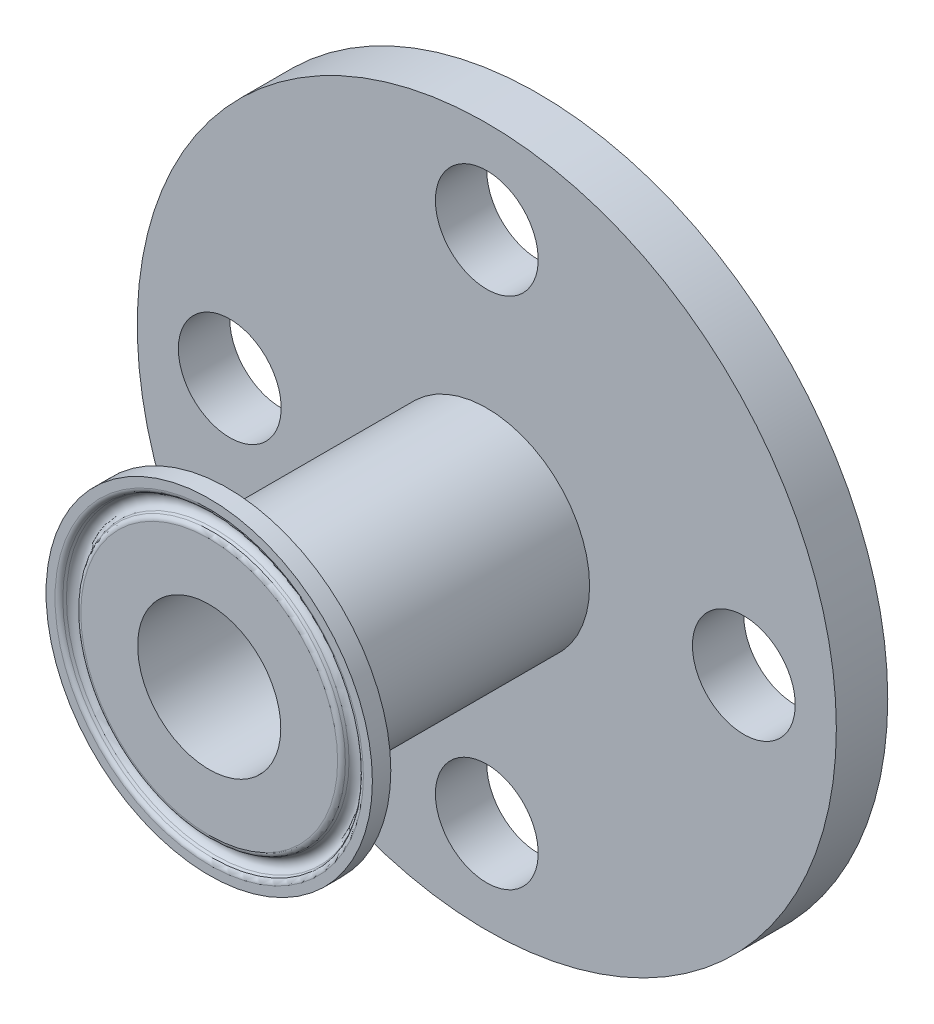
ISO-10303-21;
HEADER;
FILE_DESCRIPTION(('STEP AP214'),'2;1');
FILE_NAME('part.step','',(''),(''),'','','');
FILE_SCHEMA(('AUTOMOTIVE_DESIGN { 1 0 10303 214 1 1 1 1 }'));
ENDSEC;
DATA;
#1=APPLICATION_CONTEXT('core data for automotive mechanical design processes');
#2=APPLICATION_PROTOCOL_DEFINITION('international standard','automotive_design',2000,#1);
#3=PRODUCT_CONTEXT('',#1,'mechanical');
#4=PRODUCT('Part','Part','',(#3));
#5=PRODUCT_RELATED_PRODUCT_CATEGORY('part','',(#4));
#6=PRODUCT_DEFINITION_FORMATION('','',#4);
#7=PRODUCT_DEFINITION_CONTEXT('part definition',#1,'design');
#8=PRODUCT_DEFINITION('design','',#6,#7);
#9=PRODUCT_DEFINITION_SHAPE('','',#8);
#10=(LENGTH_UNIT() NAMED_UNIT(*) SI_UNIT(.MILLI.,.METRE.));
#11=(NAMED_UNIT(*) PLANE_ANGLE_UNIT() SI_UNIT($,.RADIAN.));
#12=(NAMED_UNIT(*) SI_UNIT($,.STERADIAN.) SOLID_ANGLE_UNIT());
#13=UNCERTAINTY_MEASURE_WITH_UNIT(LENGTH_MEASURE(1.E-05),#10,'distance_accuracy_value','');
#14=(GEOMETRIC_REPRESENTATION_CONTEXT(3) GLOBAL_UNCERTAINTY_ASSIGNED_CONTEXT((#13)) GLOBAL_UNIT_ASSIGNED_CONTEXT((#10,
#11,#12)) REPRESENTATION_CONTEXT('',''));
#15=CARTESIAN_POINT('',(0.,0.,0.));
#16=DIRECTION('',(0.,0.,1.));
#17=DIRECTION('',(1.,0.,0.));
#18=AXIS2_PLACEMENT_3D('',#15,#16,#17);
#19=CARTESIAN_POINT('',(0.,23.8091722747395,0.));
#20=DIRECTION('',(0.,0.,-1.));
#21=DIRECTION('',(-1.,0.,0.));
#22=AXIS2_PLACEMENT_3D('',#19,#20,#21);
#23=PLANE('',#22);
#24=CARTESIAN_POINT('',(0.,0.,0.));
#25=DIRECTION('',(0.,0.,1.));
#26=DIRECTION('',(1.,0.,0.));
#27=AXIS2_PLACEMENT_3D('',#24,#25,#26);
#28=CIRCLE('',#27,23.8091722747395);
#29=CARTESIAN_POINT('',(23.8091722747395,0.,0.));
#30=VERTEX_POINT('',#29);
#31=EDGE_CURVE('E10',#30,#30,#28,.T.);
#32=ORIENTED_EDGE('',*,*,#31,.F.);
#33=EDGE_LOOP('',(#32));
#34=FACE_BOUND('',#33,.T.);
#35=CARTESIAN_POINT('',(0.,0.,0.));
#36=DIRECTION('',(0.,0.,1.));
#37=DIRECTION('',(1.,0.,0.));
#38=AXIS2_PLACEMENT_3D('',#35,#36,#37);
#39=CIRCLE('',#38,25.1968);
#40=CARTESIAN_POINT('',(25.1968,0.,0.));
#41=VERTEX_POINT('',#40);
#42=EDGE_CURVE('E84',#41,#41,#39,.T.);
#43=ORIENTED_EDGE('',*,*,#42,.T.);
#44=EDGE_LOOP('',(#43));
#45=FACE_BOUND('',#44,.T.);
#46=ADVANCED_FACE('F35',(#34,#45),#23,.F.);
#47=CARTESIAN_POINT('',(0.,0.,-0.7874));
#48=DIRECTION('',(0.,0.,1.));
#49=DIRECTION('',(1.,0.,0.));
#50=AXIS2_PLACEMENT_3D('',#47,#48,#49);
#51=TOROIDAL_SURFACE('',#50,23.8091722747395,0.787400000000001);
#52=CARTESIAN_POINT('',(0.,0.,-0.479738309427546));
#53=DIRECTION('',(0.,0.,1.));
#54=DIRECTION('',(1.,0.,0.));
#55=AXIS2_PLACEMENT_3D('',#52,#53,#54);
#56=CIRCLE('',#55,23.0843667531311);
#57=CARTESIAN_POINT('',(23.0843667531311,0.,-0.479738309427546));
#58=VERTEX_POINT('',#57);
#59=EDGE_CURVE('E41',#58,#58,#56,.T.);
#60=ORIENTED_EDGE('',*,*,#59,.F.);
#61=EDGE_LOOP('',(#60));
#62=FACE_BOUND('',#61,.T.);
#63=ORIENTED_EDGE('',*,*,#31,.T.);
#64=EDGE_LOOP('',(#63));
#65=FACE_BOUND('',#64,.T.);
#66=ADVANCED_FACE('F161',(#62,#65),#51,.T.);
#67=CARTESIAN_POINT('',(0.,0.,-0.479738309427546));
#68=DIRECTION('',(0.,0.,1.));
#69=DIRECTION('',(1.,0.,0.));
#70=AXIS2_PLACEMENT_3D('',#67,#68,#69);
#71=CONICAL_SURFACE('',#70,23.0843667531311,0.401425727958695);
#72=CARTESIAN_POINT('',(0.,0.,-0.872854821190492));
#73=DIRECTION('',(0.,0.,1.));
#74=DIRECTION('',(1.,0.,0.));
#75=AXIS2_PLACEMENT_3D('',#72,#73,#74);
#76=CIRCLE('',#75,22.9174986940515);
#77=CARTESIAN_POINT('',(22.9174986940515,0.,-0.872854821190492));
#78=VERTEX_POINT('',#77);
#79=EDGE_CURVE('E45',#78,#78,#76,.T.);
#80=ORIENTED_EDGE('',*,*,#79,.F.);
#81=EDGE_LOOP('',(#80));
#82=FACE_BOUND('',#81,.T.);
#83=ORIENTED_EDGE('',*,*,#59,.T.);
#84=EDGE_LOOP('',(#83));
#85=FACE_BOUND('',#84,.T.);
#86=ADVANCED_FACE('F156',(#82,#85),#71,.F.);
#87=CARTESIAN_POINT('',(0.,0.,-0.4064));
#88=DIRECTION('',(0.,0.,1.));
#89=DIRECTION('',(1.,0.,0.));
#90=AXIS2_PLACEMENT_3D('',#87,#88,#89);
#91=TOROIDAL_SURFACE('',#90,21.8186,1.1938);
#92=CARTESIAN_POINT('',(0.,0.,-0.872854821190497));
#93=DIRECTION('',(0.,0.,1.));
#94=DIRECTION('',(1.,0.,0.));
#95=AXIS2_PLACEMENT_3D('',#92,#93,#94);
#96=CIRCLE('',#95,20.7197013059485);
#97=CARTESIAN_POINT('',(20.7197013059485,0.,-0.872854821190497));
#98=VERTEX_POINT('',#97);
#99=EDGE_CURVE('E49',#98,#98,#96,.T.);
#100=ORIENTED_EDGE('',*,*,#99,.F.);
#101=EDGE_LOOP('',(#100));
#102=FACE_BOUND('',#101,.T.);
#103=ORIENTED_EDGE('',*,*,#79,.T.);
#104=EDGE_LOOP('',(#103));
#105=FACE_BOUND('',#104,.T.);
#106=ADVANCED_FACE('F150',(#102,#105),#91,.F.);
#107=CARTESIAN_POINT('',(0.,0.,-0.872854821190497));
#108=DIRECTION('',(0.,0.,-1.));
#109=DIRECTION('',(-1.,0.,0.));
#110=AXIS2_PLACEMENT_3D('',#107,#108,#109);
#111=CONICAL_SURFACE('',#110,20.7197013059485,0.401425727958704);
#112=CARTESIAN_POINT('',(0.,0.,-0.479738309427545));
#113=DIRECTION('',(0.,0.,1.));
#114=DIRECTION('',(1.,0.,0.));
#115=AXIS2_PLACEMENT_3D('',#112,#113,#114);
#116=CIRCLE('',#115,20.5528332468689);
#117=CARTESIAN_POINT('',(20.5528332468689,0.,-0.479738309427545));
#118=VERTEX_POINT('',#117);
#119=EDGE_CURVE('E54',#118,#118,#116,.T.);
#120=ORIENTED_EDGE('',*,*,#119,.F.);
#121=EDGE_LOOP('',(#120));
#122=FACE_BOUND('',#121,.T.);
#123=ORIENTED_EDGE('',*,*,#99,.T.);
#124=EDGE_LOOP('',(#123));
#125=FACE_BOUND('',#124,.T.);
#126=ADVANCED_FACE('F144',(#122,#125),#111,.T.);
#127=CARTESIAN_POINT('',(0.,0.,-0.7874));
#128=DIRECTION('',(0.,0.,1.));
#129=DIRECTION('',(1.,0.,0.));
#130=AXIS2_PLACEMENT_3D('',#127,#128,#129);
#131=TOROIDAL_SURFACE('',#130,19.8280277252605,0.787400000000003);
#132=CARTESIAN_POINT('',(0.,0.,0.));
#133=DIRECTION('',(0.,0.,1.));
#134=DIRECTION('',(1.,0.,0.));
#135=AXIS2_PLACEMENT_3D('',#132,#133,#134);
#136=CIRCLE('',#135,19.8280277252605);
#137=CARTESIAN_POINT('',(19.8280277252605,0.,0.));
#138=VERTEX_POINT('',#137);
#139=EDGE_CURVE('E57',#138,#138,#136,.T.);
#140=ORIENTED_EDGE('',*,*,#139,.F.);
#141=EDGE_LOOP('',(#140));
#142=FACE_BOUND('',#141,.T.);
#143=ORIENTED_EDGE('',*,*,#119,.T.);
#144=EDGE_LOOP('',(#143));
#145=FACE_BOUND('',#144,.T.);
#146=ADVANCED_FACE('F138',(#142,#145),#131,.T.);
#147=CARTESIAN_POINT('',(0.,11.049,0.));
#148=DIRECTION('',(0.,0.,-1.));
#149=DIRECTION('',(-1.,0.,0.));
#150=AXIS2_PLACEMENT_3D('',#147,#148,#149);
#151=PLANE('',#150);
#152=CARTESIAN_POINT('',(0.,0.,0.));
#153=DIRECTION('',(0.,0.,1.));
#154=DIRECTION('',(1.,0.,0.));
#155=AXIS2_PLACEMENT_3D('',#152,#153,#154);
#156=CIRCLE('',#155,11.049);
#157=CARTESIAN_POINT('',(11.049,0.,0.));
#158=VERTEX_POINT('',#157);
#159=EDGE_CURVE('E60',#158,#158,#156,.T.);
#160=ORIENTED_EDGE('',*,*,#159,.F.);
#161=EDGE_LOOP('',(#160));
#162=FACE_BOUND('',#161,.T.);
#163=ORIENTED_EDGE('',*,*,#139,.T.);
#164=EDGE_LOOP('',(#163));
#165=FACE_BOUND('',#164,.T.);
#166=ADVANCED_FACE('F132',(#162,#165),#151,.F.);
#167=CARTESIAN_POINT('',(0.,0.,0.));
#168=DIRECTION('',(0.,0.,1.));
#169=DIRECTION('',(1.,0.,0.));
#170=AXIS2_PLACEMENT_3D('',#167,#168,#169);
#171=CYLINDRICAL_SURFACE('',#170,11.049);
#172=CARTESIAN_POINT('',(0.,0.,-50.8));
#173=DIRECTION('',(0.,0.,1.));
#174=DIRECTION('',(1.,0.,0.));
#175=AXIS2_PLACEMENT_3D('',#172,#173,#174);
#176=CIRCLE('',#175,11.049);
#177=CARTESIAN_POINT('',(11.049,0.,-50.8));
#178=VERTEX_POINT('',#177);
#179=EDGE_CURVE('E63',#178,#178,#176,.T.);
#180=ORIENTED_EDGE('',*,*,#179,.F.);
#181=EDGE_LOOP('',(#180));
#182=FACE_BOUND('',#181,.T.);
#183=ORIENTED_EDGE('',*,*,#159,.T.);
#184=EDGE_LOOP('',(#183));
#185=FACE_BOUND('',#184,.T.);
#186=ADVANCED_FACE('F118',(#182,#185),#171,.F.);
#187=CARTESIAN_POINT('',(0.,28.575,-50.8));
#188=DIRECTION('',(0.,0.,1.));
#189=DIRECTION('',(1.,0.,0.));
#190=AXIS2_PLACEMENT_3D('',#187,#188,#189);
#191=PLANE('',#190);
#192=CARTESIAN_POINT('',(39.6875,0.,-50.8));
#193=DIRECTION('',(0.,0.,-1.));
#194=DIRECTION('',(-1.,0.,0.));
#195=AXIS2_PLACEMENT_3D('',#192,#193,#194);
#196=CIRCLE('',#195,7.9375);
#197=CARTESIAN_POINT('',(31.75,0.,-50.8));
#198=VERTEX_POINT('',#197);
#199=EDGE_CURVE('E108',#198,#198,#196,.T.);
#200=ORIENTED_EDGE('',*,*,#199,.F.);
#201=EDGE_LOOP('',(#200));
#202=FACE_BOUND('',#201,.T.);
#203=CARTESIAN_POINT('',(0.,-39.6875,-50.8));
#204=DIRECTION('',(0.,0.,-1.));
#205=DIRECTION('',(-1.,0.,0.));
#206=AXIS2_PLACEMENT_3D('',#203,#204,#205);
#207=CIRCLE('',#206,7.9375);
#208=CARTESIAN_POINT('',(-7.9375,-39.6875,-50.8));
#209=VERTEX_POINT('',#208);
#210=EDGE_CURVE('E102',#209,#209,#207,.T.);
#211=ORIENTED_EDGE('',*,*,#210,.F.);
#212=EDGE_LOOP('',(#211));
#213=FACE_BOUND('',#212,.T.);
#214=CARTESIAN_POINT('',(-39.6875,0.,-50.8));
#215=DIRECTION('',(0.,0.,-1.));
#216=DIRECTION('',(-1.,0.,0.));
#217=AXIS2_PLACEMENT_3D('',#214,#215,#216);
#218=CIRCLE('',#217,7.9375);
#219=CARTESIAN_POINT('',(-47.625,0.,-50.8));
#220=VERTEX_POINT('',#219);
#221=EDGE_CURVE('E96',#220,#220,#218,.T.);
#222=ORIENTED_EDGE('',*,*,#221,.F.);
#223=EDGE_LOOP('',(#222));
#224=FACE_BOUND('',#223,.T.);
#225=CARTESIAN_POINT('',(0.,39.6875,-50.8));
#226=DIRECTION('',(0.,0.,-1.));
#227=DIRECTION('',(-1.,0.,0.));
#228=AXIS2_PLACEMENT_3D('',#225,#226,#227);
#229=CIRCLE('',#228,7.9375);
#230=CARTESIAN_POINT('',(-7.9375,39.6875,-50.8));
#231=VERTEX_POINT('',#230);
#232=EDGE_CURVE('E90',#231,#231,#229,.T.);
#233=ORIENTED_EDGE('',*,*,#232,.F.);
#234=EDGE_LOOP('',(#233));
#235=FACE_BOUND('',#234,.T.);
#236=CARTESIAN_POINT('',(0.,0.,-50.8));
#237=DIRECTION('',(0.,0.,1.));
#238=DIRECTION('',(1.,0.,0.));
#239=AXIS2_PLACEMENT_3D('',#236,#237,#238);
#240=CIRCLE('',#239,53.975);
#241=CARTESIAN_POINT('',(53.975,0.,-50.8));
#242=VERTEX_POINT('',#241);
#243=EDGE_CURVE('E66',#242,#242,#240,.T.);
#244=ORIENTED_EDGE('',*,*,#243,.F.);
#245=EDGE_LOOP('',(#244));
#246=FACE_BOUND('',#245,.T.);
#247=ORIENTED_EDGE('',*,*,#179,.T.);
#248=EDGE_LOOP('',(#247));
#249=FACE_BOUND('',#248,.T.);
#250=ADVANCED_FACE('F114',(#202,#213,#224,#235,#246,#249),#191,.F.);
#251=CARTESIAN_POINT('',(0.,0.,0.));
#252=DIRECTION('',(0.,0.,1.));
#253=DIRECTION('',(1.,0.,0.));
#254=AXIS2_PLACEMENT_3D('',#251,#252,#253);
#255=CYLINDRICAL_SURFACE('',#254,53.975);
#256=CARTESIAN_POINT('',(0.,0.,-42.8625));
#257=DIRECTION('',(0.,0.,1.));
#258=DIRECTION('',(1.,0.,0.));
#259=AXIS2_PLACEMENT_3D('',#256,#257,#258);
#260=CIRCLE('',#259,53.975);
#261=CARTESIAN_POINT('',(53.975,0.,-42.8625));
#262=VERTEX_POINT('',#261);
#263=EDGE_CURVE('E69',#262,#262,#260,.T.);
#264=ORIENTED_EDGE('',*,*,#263,.F.);
#265=EDGE_LOOP('',(#264));
#266=FACE_BOUND('',#265,.T.);
#267=ORIENTED_EDGE('',*,*,#243,.T.);
#268=EDGE_LOOP('',(#267));
#269=FACE_BOUND('',#268,.T.);
#270=ADVANCED_FACE('F117',(#266,#269),#255,.T.);
#271=CARTESIAN_POINT('',(0.,15.875,-42.8625));
#272=DIRECTION('',(0.,0.,-1.));
#273=DIRECTION('',(-1.,0.,0.));
#274=AXIS2_PLACEMENT_3D('',#271,#272,#273);
#275=PLANE('',#274);
#276=CARTESIAN_POINT('',(39.6875,0.,-42.8625));
#277=DIRECTION('',(0.,0.,-1.));
#278=DIRECTION('',(-1.,0.,0.));
#279=AXIS2_PLACEMENT_3D('',#276,#277,#278);
#280=CIRCLE('',#279,7.9375);
#281=CARTESIAN_POINT('',(31.75,0.,-42.8625));
#282=VERTEX_POINT('',#281);
#283=EDGE_CURVE('E105',#282,#282,#280,.F.);
#284=ORIENTED_EDGE('',*,*,#283,.F.);
#285=EDGE_LOOP('',(#284));
#286=FACE_BOUND('',#285,.T.);
#287=CARTESIAN_POINT('',(0.,-39.6875,-42.8625));
#288=DIRECTION('',(0.,0.,-1.));
#289=DIRECTION('',(-1.,0.,0.));
#290=AXIS2_PLACEMENT_3D('',#287,#288,#289);
#291=CIRCLE('',#290,7.9375);
#292=CARTESIAN_POINT('',(-7.9375,-39.6875,-42.8625));
#293=VERTEX_POINT('',#292);
#294=EDGE_CURVE('E99',#293,#293,#291,.F.);
#295=ORIENTED_EDGE('',*,*,#294,.F.);
#296=EDGE_LOOP('',(#295));
#297=FACE_BOUND('',#296,.T.);
#298=CARTESIAN_POINT('',(-39.6875,0.,-42.8625));
#299=DIRECTION('',(0.,0.,-1.));
#300=DIRECTION('',(-1.,0.,0.));
#301=AXIS2_PLACEMENT_3D('',#298,#299,#300);
#302=CIRCLE('',#301,7.9375);
#303=CARTESIAN_POINT('',(-47.625,0.,-42.8625));
#304=VERTEX_POINT('',#303);
#305=EDGE_CURVE('E93',#304,#304,#302,.F.);
#306=ORIENTED_EDGE('',*,*,#305,.F.);
#307=EDGE_LOOP('',(#306));
#308=FACE_BOUND('',#307,.T.);
#309=CARTESIAN_POINT('',(0.,39.6875,-42.8625));
#310=DIRECTION('',(0.,0.,-1.));
#311=DIRECTION('',(-1.,0.,0.));
#312=AXIS2_PLACEMENT_3D('',#309,#310,#311);
#313=CIRCLE('',#312,7.9375);
#314=CARTESIAN_POINT('',(-7.9375,39.6875,-42.8625));
#315=VERTEX_POINT('',#314);
#316=EDGE_CURVE('E87',#315,#315,#313,.F.);
#317=ORIENTED_EDGE('',*,*,#316,.F.);
#318=EDGE_LOOP('',(#317));
#319=FACE_BOUND('',#318,.T.);
#320=CARTESIAN_POINT('',(0.,0.,-42.8625));
#321=DIRECTION('',(0.,0.,1.));
#322=DIRECTION('',(1.,0.,0.));
#323=AXIS2_PLACEMENT_3D('',#320,#321,#322);
#324=CIRCLE('',#323,15.875);
#325=CARTESIAN_POINT('',(15.875,0.,-42.8625));
#326=VERTEX_POINT('',#325);
#327=EDGE_CURVE('E72',#326,#326,#324,.T.);
#328=ORIENTED_EDGE('',*,*,#327,.F.);
#329=EDGE_LOOP('',(#328));
#330=FACE_BOUND('',#329,.T.);
#331=ORIENTED_EDGE('',*,*,#263,.T.);
#332=EDGE_LOOP('',(#331));
#333=FACE_BOUND('',#332,.T.);
#334=ADVANCED_FACE('F196',(#286,#297,#308,#319,#330,#333),#275,.F.);
#335=CARTESIAN_POINT('',(0.,0.,0.));
#336=DIRECTION('',(0.,0.,1.));
#337=DIRECTION('',(1.,0.,0.));
#338=AXIS2_PLACEMENT_3D('',#335,#336,#337);
#339=CYLINDRICAL_SURFACE('',#338,15.875);
#340=CARTESIAN_POINT('',(0.,0.,-8.46081666359846));
#341=DIRECTION('',(0.,0.,1.));
#342=DIRECTION('',(1.,0.,0.));
#343=AXIS2_PLACEMENT_3D('',#340,#341,#342);
#344=CIRCLE('',#343,15.875);
#345=CARTESIAN_POINT('',(15.875,0.,-8.46081666359846));
#346=VERTEX_POINT('',#345);
#347=EDGE_CURVE('E75',#346,#346,#344,.T.);
#348=ORIENTED_EDGE('',*,*,#347,.F.);
#349=EDGE_LOOP('',(#348));
#350=FACE_BOUND('',#349,.T.);
#351=ORIENTED_EDGE('',*,*,#327,.T.);
#352=EDGE_LOOP('',(#351));
#353=FACE_BOUND('',#352,.T.);
#354=ADVANCED_FACE('F190',(#350,#353),#339,.T.);
#355=CARTESIAN_POINT('',(0.,0.,-8.46081666359846));
#356=DIRECTION('',(0.,0.,1.));
#357=DIRECTION('',(1.,0.,0.));
#358=AXIS2_PLACEMENT_3D('',#355,#356,#357);
#359=TOROIDAL_SURFACE('',#358,19.05,3.175);
#360=CARTESIAN_POINT('',(0.,0.,-5.4772925926032));
#361=DIRECTION('',(0.,0.,1.));
#362=DIRECTION('',(1.,0.,0.));
#363=AXIS2_PLACEMENT_3D('',#360,#361,#362);
#364=CIRCLE('',#363,17.964086044941);
#365=CARTESIAN_POINT('',(17.964086044941,0.,-5.4772925926032));
#366=VERTEX_POINT('',#365);
#367=EDGE_CURVE('E78',#366,#366,#364,.T.);
#368=ORIENTED_EDGE('',*,*,#367,.F.);
#369=EDGE_LOOP('',(#368));
#370=FACE_BOUND('',#369,.T.);
#371=ORIENTED_EDGE('',*,*,#347,.T.);
#372=EDGE_LOOP('',(#371));
#373=FACE_BOUND('',#372,.T.);
#374=ADVANCED_FACE('F184',(#370,#373),#359,.F.);
#375=CARTESIAN_POINT('',(0.,0.,-5.4772925926032));
#376=DIRECTION('',(0.,0.,1.));
#377=DIRECTION('',(1.,0.,0.));
#378=AXIS2_PLACEMENT_3D('',#375,#376,#377);
#379=CONICAL_SURFACE('',#378,17.964086044941,1.22173047639604);
#380=CARTESIAN_POINT('',(0.,0.,-2.8448));
#381=DIRECTION('',(0.,0.,1.));
#382=DIRECTION('',(1.,0.,0.));
#383=AXIS2_PLACEMENT_3D('',#380,#381,#382);
#384=CIRCLE('',#383,25.1968);
#385=CARTESIAN_POINT('',(25.1968,0.,-2.8448));
#386=VERTEX_POINT('',#385);
#387=EDGE_CURVE('E81',#386,#386,#384,.T.);
#388=ORIENTED_EDGE('',*,*,#387,.F.);
#389=EDGE_LOOP('',(#388));
#390=FACE_BOUND('',#389,.T.);
#391=ORIENTED_EDGE('',*,*,#367,.T.);
#392=EDGE_LOOP('',(#391));
#393=FACE_BOUND('',#392,.T.);
#394=ADVANCED_FACE('F178',(#390,#393),#379,.T.);
#395=CARTESIAN_POINT('',(0.,0.,0.));
#396=DIRECTION('',(0.,0.,1.));
#397=DIRECTION('',(1.,0.,0.));
#398=AXIS2_PLACEMENT_3D('',#395,#396,#397);
#399=CYLINDRICAL_SURFACE('',#398,25.1968);
#400=ORIENTED_EDGE('',*,*,#42,.F.);
#401=EDGE_LOOP('',(#400));
#402=FACE_BOUND('',#401,.T.);
#403=ORIENTED_EDGE('',*,*,#387,.T.);
#404=EDGE_LOOP('',(#403));
#405=FACE_BOUND('',#404,.T.);
#406=ADVANCED_FACE('F174',(#402,#405),#399,.T.);
#407=CARTESIAN_POINT('',(0.,39.6875,-20.4118596973271));
#408=DIRECTION('',(0.,0.,-1.));
#409=DIRECTION('',(-1.,0.,0.));
#410=AXIS2_PLACEMENT_3D('',#407,#408,#409);
#411=CYLINDRICAL_SURFACE('',#410,7.9375);
#412=ORIENTED_EDGE('',*,*,#316,.T.);
#413=EDGE_LOOP('',(#412));
#414=FACE_BOUND('',#413,.T.);
#415=ORIENTED_EDGE('',*,*,#232,.T.);
#416=EDGE_LOOP('',(#415));
#417=FACE_BOUND('',#416,.T.);
#418=ADVANCED_FACE('F177',(#414,#417),#411,.F.);
#419=CARTESIAN_POINT('',(-39.6875,0.,-20.4118596973271));
#420=DIRECTION('',(0.,0.,-1.));
#421=DIRECTION('',(-1.,0.,0.));
#422=AXIS2_PLACEMENT_3D('',#419,#420,#421);
#423=CYLINDRICAL_SURFACE('',#422,7.9375);
#424=ORIENTED_EDGE('',*,*,#305,.T.);
#425=EDGE_LOOP('',(#424));
#426=FACE_BOUND('',#425,.T.);
#427=ORIENTED_EDGE('',*,*,#221,.T.);
#428=EDGE_LOOP('',(#427));
#429=FACE_BOUND('',#428,.T.);
#430=ADVANCED_FACE('F214',(#426,#429),#423,.F.);
#431=CARTESIAN_POINT('',(0.,-39.6875,-20.4118596973271));
#432=DIRECTION('',(0.,0.,-1.));
#433=DIRECTION('',(-1.,0.,0.));
#434=AXIS2_PLACEMENT_3D('',#431,#432,#433);
#435=CYLINDRICAL_SURFACE('',#434,7.9375);
#436=ORIENTED_EDGE('',*,*,#294,.T.);
#437=EDGE_LOOP('',(#436));
#438=FACE_BOUND('',#437,.T.);
#439=ORIENTED_EDGE('',*,*,#210,.T.);
#440=EDGE_LOOP('',(#439));
#441=FACE_BOUND('',#440,.T.);
#442=ADVANCED_FACE('F218',(#438,#441),#435,.F.);
#443=CARTESIAN_POINT('',(39.6875,0.,-20.4118596973271));
#444=DIRECTION('',(0.,0.,-1.));
#445=DIRECTION('',(-1.,0.,0.));
#446=AXIS2_PLACEMENT_3D('',#443,#444,#445);
#447=CYLINDRICAL_SURFACE('',#446,7.9375);
#448=ORIENTED_EDGE('',*,*,#283,.T.);
#449=EDGE_LOOP('',(#448));
#450=FACE_BOUND('',#449,.T.);
#451=ORIENTED_EDGE('',*,*,#199,.T.);
#452=EDGE_LOOP('',(#451));
#453=FACE_BOUND('',#452,.T.);
#454=ADVANCED_FACE('F112',(#450,#453),#447,.F.);
#455=CLOSED_SHELL('',(#46,#66,#86,#106,#126,#146,#166,#186,#250,#270,#334,#354,#374,#394,#406,
#418,#430,#442,#454));
#456=MANIFOLD_SOLID_BREP('B2',#455);
#457=ADVANCED_BREP_SHAPE_REPRESENTATION('',(#18,#456),#14);
#458=SHAPE_DEFINITION_REPRESENTATION(#9,#457);
ENDSEC;
END-ISO-10303-21;
